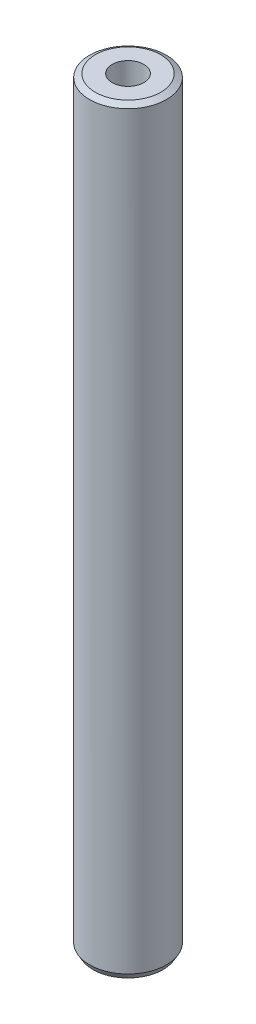
ISO-10303-21;
HEADER;
FILE_DESCRIPTION(('STEP AP214'),'2;1');
FILE_NAME('part.step','',(''),(''),'','','');
FILE_SCHEMA(('AUTOMOTIVE_DESIGN { 1 0 10303 214 1 1 1 1 }'));
ENDSEC;
DATA;
#1=APPLICATION_CONTEXT('core data for automotive mechanical design processes');
#2=APPLICATION_PROTOCOL_DEFINITION('international standard','automotive_design',2000,#1);
#3=PRODUCT_CONTEXT('',#1,'mechanical');
#4=PRODUCT('Part','Part','',(#3));
#5=PRODUCT_RELATED_PRODUCT_CATEGORY('part','',(#4));
#6=PRODUCT_DEFINITION_FORMATION('','',#4);
#7=PRODUCT_DEFINITION_CONTEXT('part definition',#1,'design');
#8=PRODUCT_DEFINITION('design','',#6,#7);
#9=PRODUCT_DEFINITION_SHAPE('','',#8);
#10=(LENGTH_UNIT() NAMED_UNIT(*) SI_UNIT(.MILLI.,.METRE.));
#11=(NAMED_UNIT(*) PLANE_ANGLE_UNIT() SI_UNIT($,.RADIAN.));
#12=(NAMED_UNIT(*) SI_UNIT($,.STERADIAN.) SOLID_ANGLE_UNIT());
#13=UNCERTAINTY_MEASURE_WITH_UNIT(LENGTH_MEASURE(1.E-05),#10,'distance_accuracy_value','');
#14=(GEOMETRIC_REPRESENTATION_CONTEXT(3) GLOBAL_UNCERTAINTY_ASSIGNED_CONTEXT((#13)) GLOBAL_UNIT_ASSIGNED_CONTEXT((#10,
#11,#12)) REPRESENTATION_CONTEXT('',''));
#15=CARTESIAN_POINT('',(0.,0.,0.));
#16=DIRECTION('',(0.,0.,1.));
#17=DIRECTION('',(1.,0.,0.));
#18=AXIS2_PLACEMENT_3D('',#15,#16,#17);
#19=CARTESIAN_POINT('',(0.,493.208778863067,0.));
#20=DIRECTION('',(0.,-1.,0.));
#21=DIRECTION('',(0.,0.,-1.));
#22=AXIS2_PLACEMENT_3D('',#19,#20,#21);
#23=CYLINDRICAL_SURFACE('',#22,25.);
#24=CARTESIAN_POINT('',(0.,491.027325995517,0.));
#25=DIRECTION('',(0.,1.,0.));
#26=DIRECTION('',(0.,0.,1.));
#27=AXIS2_PLACEMENT_3D('',#24,#25,#26);
#28=CIRCLE('',#27,25.);
#29=CARTESIAN_POINT('',(0.,491.027325995517,-25.));
#30=VERTEX_POINT('',#29);
#31=EDGE_CURVE('E50',#30,#30,#28,.F.);
#32=CARTESIAN_POINT('',(0.,3.77838720091417,0.));
#33=DIRECTION('',(0.,1.,0.));
#34=DIRECTION('',(0.,0.,1.));
#35=AXIS2_PLACEMENT_3D('',#32,#33,#34);
#36=CIRCLE('',#35,25.);
#37=CARTESIAN_POINT('',(0.,3.77838720091411,-25.));
#38=VERTEX_POINT('',#37);
#39=EDGE_CURVE('E51',#38,#38,#36,.T.);
#40=CARTESIAN_POINT('',(0.,491.027325995517,-25.));
#41=CARTESIAN_POINT('',(0.,485.951816216407,-25.));
#42=CARTESIAN_POINT('',(0.,480.876306437297,-25.));
#43=CARTESIAN_POINT('',(0.,470.725286879076,-25.));
#44=CARTESIAN_POINT('',(0.,465.649777099965,-25.));
#45=CARTESIAN_POINT('',(0.,455.498757541744,-25.));
#46=CARTESIAN_POINT('',(0.,450.423247762634,-25.));
#47=CARTESIAN_POINT('',(0.,440.272228204413,-25.));
#48=CARTESIAN_POINT('',(0.,435.196718425302,-25.));
#49=CARTESIAN_POINT('',(0.,425.045698867082,-25.));
#50=CARTESIAN_POINT('',(0.,419.970189087971,-25.));
#51=CARTESIAN_POINT('',(0.,409.81916952975,-25.));
#52=CARTESIAN_POINT('',(0.,404.74365975064,-25.));
#53=CARTESIAN_POINT('',(0.,394.592640192419,-25.));
#54=CARTESIAN_POINT('',(0.,389.517130413308,-25.));
#55=CARTESIAN_POINT('',(0.,379.366110855087,-25.));
#56=CARTESIAN_POINT('',(0.,374.290601075977,-25.));
#57=CARTESIAN_POINT('',(0.,364.139581517756,-25.));
#58=CARTESIAN_POINT('',(0.,359.064071738646,-25.));
#59=CARTESIAN_POINT('',(0.,348.913052180425,-25.));
#60=CARTESIAN_POINT('',(0.,343.837542401314,-25.));
#61=CARTESIAN_POINT('',(0.,333.686522843093,-25.));
#62=CARTESIAN_POINT('',(0.,328.611013063983,-25.));
#63=CARTESIAN_POINT('',(0.,318.459993505762,-25.));
#64=CARTESIAN_POINT('',(0.,313.384483726652,-25.));
#65=CARTESIAN_POINT('',(0.,303.233464168431,-25.));
#66=CARTESIAN_POINT('',(0.,298.15795438932,-25.));
#67=CARTESIAN_POINT('',(0.,288.006934831099,-25.));
#68=CARTESIAN_POINT('',(0.,282.931425051989,-25.));
#69=CARTESIAN_POINT('',(0.,272.780405493768,-25.));
#70=CARTESIAN_POINT('',(0.,267.704895714658,-25.));
#71=CARTESIAN_POINT('',(0.,257.553876156437,-25.));
#72=CARTESIAN_POINT('',(0.,252.478366377326,-25.));
#73=CARTESIAN_POINT('',(0.,242.327346819105,-25.));
#74=CARTESIAN_POINT('',(0.,237.251837039995,-25.));
#75=CARTESIAN_POINT('',(0.,227.100817481774,-25.));
#76=CARTESIAN_POINT('',(0.,222.025307702664,-25.));
#77=CARTESIAN_POINT('',(0.,211.874288144443,-25.));
#78=CARTESIAN_POINT('',(0.,206.798778365332,-25.));
#79=CARTESIAN_POINT('',(0.,196.647758807111,-25.));
#80=CARTESIAN_POINT('',(0.,191.572249028001,-25.));
#81=CARTESIAN_POINT('',(0.,181.42122946978,-25.));
#82=CARTESIAN_POINT('',(0.,176.345719690669,-25.));
#83=CARTESIAN_POINT('',(0.,166.194700132449,-25.));
#84=CARTESIAN_POINT('',(0.,161.119190353338,-25.));
#85=CARTESIAN_POINT('',(0.,150.968170795117,-25.));
#86=CARTESIAN_POINT('',(0.,145.892661016007,-25.));
#87=CARTESIAN_POINT('',(0.,135.741641457786,-25.));
#88=CARTESIAN_POINT('',(0.,130.666131678675,-25.));
#89=CARTESIAN_POINT('',(0.,120.515112120455,-25.));
#90=CARTESIAN_POINT('',(0.,115.439602341344,-25.));
#91=CARTESIAN_POINT('',(0.,105.288582783123,-25.));
#92=CARTESIAN_POINT('',(0.,100.213073004013,-25.));
#93=CARTESIAN_POINT('',(0.,90.0620534457918,-25.));
#94=CARTESIAN_POINT('',(0.,84.9865436666813,-25.));
#95=CARTESIAN_POINT('',(0.,74.8355241084604,-25.));
#96=CARTESIAN_POINT('',(0.,69.76001432935,-25.));
#97=CARTESIAN_POINT('',(0.,59.6089947711291,-25.));
#98=CARTESIAN_POINT('',(0.,54.5334849920187,-25.));
#99=CARTESIAN_POINT('',(0.,44.3824654337978,-25.));
#100=CARTESIAN_POINT('',(0.,39.3069556546873,-25.));
#101=CARTESIAN_POINT('',(0.,29.1559360964664,-25.));
#102=CARTESIAN_POINT('',(0.,24.0804263173559,-25.));
#103=CARTESIAN_POINT('',(0.,13.929406759135,-25.));
#104=CARTESIAN_POINT('',(0.,8.85389698002458,-25.));
#105=CARTESIAN_POINT('',(0.,3.77838720091411,-25.));
#106=B_SPLINE_CURVE_WITH_KNOTS('',3,(#40,#41,#42,#43,#44,#45,#46,#47,#48,#49,#50,#51,#52,#53,
#54,#55,#56,#57,#58,#59,#60,#61,#62,#63,#64,#65,#66,#67,#68,#69,#70,#71,#72,#73,#74,#75,#76,#77,
#78,#79,#80,#81,#82,#83,#84,#85,#86,#87,#88,#89,#90,#91,#92,#93,#94,#95,#96,#97,#98,#99,#100,
#101,#102,#103,#104,#105),.UNSPECIFIED.,.F.,.F.,(4,2,2,2,2,2,2,2,2,2,2,2,2,2,2,2,2,2,2,2,2,2,2,
2,2,2,2,2,2,2,2,2,4),(0.,15.2265293373314,30.4530586746627,45.6795880119941,60.9061173493254,
76.1326466866568,91.3591760239881,106.585705361319,121.812234698651,137.038764035982,
152.265293373314,167.491822710645,182.718352047976,197.944881385308,213.171410722639,
228.39794005997,243.624469397302,258.850998734633,274.077528071964,289.304057409296,
304.530586746627,319.757116083958,334.98364542129,350.210174758621,365.436704095952,
380.663233433284,395.889762770615,411.116292107947,426.342821445278,441.569350782609,
456.795880119941,472.022409457272,487.248938794603),.UNSPECIFIED.);
#107=EDGE_CURVE('BSEAM39',#30,#38,#106,.T.);
#108=ORIENTED_EDGE('',*,*,#31,.T.);
#109=ORIENTED_EDGE('',*,*,#39,.T.);
#110=ORIENTED_EDGE('',*,*,#107,.T.);
#111=ORIENTED_EDGE('',*,*,#107,.F.);
#112=EDGE_LOOP('',(#108,#110,#109,#111));
#113=FACE_BOUND('',#112,.T.);
#114=ADVANCED_FACE('F39',(#113),#23,.T.);
#115=CARTESIAN_POINT('',(0.,493.208778863067,0.));
#116=DIRECTION('',(0.,1.,0.));
#117=DIRECTION('',(0.,0.,1.));
#118=AXIS2_PLACEMENT_3D('',#115,#116,#117);
#119=PLANE('',#118);
#120=CARTESIAN_POINT('',(0.,493.208778863067,0.));
#121=DIRECTION('',(0.,1.,0.));
#122=DIRECTION('',(0.,0.,1.));
#123=AXIS2_PLACEMENT_3D('',#120,#121,#122);
#124=CIRCLE('',#123,21.2216127990871);
#125=CARTESIAN_POINT('',(0.,493.208778863067,21.2216127990871));
#126=VERTEX_POINT('',#125);
#127=EDGE_CURVE('E54',#126,#126,#124,.T.);
#128=ORIENTED_EDGE('',*,*,#127,.T.);
#129=EDGE_LOOP('',(#128));
#130=FACE_BOUND('',#129,.T.);
#131=CARTESIAN_POINT('',(0.,493.208778863067,0.));
#132=DIRECTION('',(0.,1.,0.));
#133=DIRECTION('',(0.,0.,1.));
#134=AXIS2_PLACEMENT_3D('',#131,#132,#133);
#135=CIRCLE('',#134,10.2938103328602);
#136=CARTESIAN_POINT('',(0.,493.208778863067,-10.2938103328602));
#137=VERTEX_POINT('',#136);
#138=EDGE_CURVE('E58',#137,#137,#135,.T.);
#139=ORIENTED_EDGE('',*,*,#138,.F.);
#140=EDGE_LOOP('',(#139));
#141=FACE_BOUND('',#140,.T.);
#142=ADVANCED_FACE('F69',(#130,#141),#119,.T.);
#143=CARTESIAN_POINT('',(0.,0.,0.));
#144=DIRECTION('',(0.,1.,0.));
#145=DIRECTION('',(0.,0.,1.));
#146=AXIS2_PLACEMENT_3D('',#143,#144,#145);
#147=PLANE('',#146);
#148=CARTESIAN_POINT('',(0.,0.,0.));
#149=DIRECTION('',(0.,1.,0.));
#150=DIRECTION('',(0.,0.,1.));
#151=AXIS2_PLACEMENT_3D('',#148,#149,#150);
#152=CIRCLE('',#151,22.8185471324495);
#153=CARTESIAN_POINT('',(0.,0.,22.8185471324495));
#154=VERTEX_POINT('',#153);
#155=EDGE_CURVE('E10',#154,#154,#152,.F.);
#156=ORIENTED_EDGE('',*,*,#155,.T.);
#157=EDGE_LOOP('',(#156));
#158=FACE_BOUND('',#157,.T.);
#159=CARTESIAN_POINT('',(0.,0.,0.));
#160=DIRECTION('',(0.,1.,0.));
#161=DIRECTION('',(0.,0.,1.));
#162=AXIS2_PLACEMENT_3D('',#159,#160,#161);
#163=CIRCLE('',#162,10.2938103328602);
#164=CARTESIAN_POINT('',(0.,0.,-10.2938103328602));
#165=VERTEX_POINT('',#164);
#166=EDGE_CURVE('E63',#165,#165,#163,.T.);
#167=ORIENTED_EDGE('',*,*,#166,.T.);
#168=EDGE_LOOP('',(#167));
#169=FACE_BOUND('',#168,.T.);
#170=ADVANCED_FACE('F75',(#158,#169),#147,.F.);
#171=CARTESIAN_POINT('',(0.,493.208778863067,0.));
#172=DIRECTION('',(0.,-1.,0.));
#173=DIRECTION('',(0.,0.,-1.));
#174=AXIS2_PLACEMENT_3D('',#171,#172,#173);
#175=CYLINDRICAL_SURFACE('',#174,10.2938103328602);
#176=CARTESIAN_POINT('',(0.,493.208778863067,-10.2938103328602));
#177=CARTESIAN_POINT('',(0.,488.071187416577,-10.2938103328602));
#178=CARTESIAN_POINT('',(0.,482.933595970087,-10.2938103328602));
#179=CARTESIAN_POINT('',(0.,472.658413077106,-10.2938103328602));
#180=CARTESIAN_POINT('',(0.,467.520821630616,-10.2938103328602));
#181=CARTESIAN_POINT('',(0.,457.245638737635,-10.2938103328602));
#182=CARTESIAN_POINT('',(0.,452.108047291145,-10.2938103328602));
#183=CARTESIAN_POINT('',(0.,441.832864398164,-10.2938103328602));
#184=CARTESIAN_POINT('',(0.,436.695272951674,-10.2938103328602));
#185=CARTESIAN_POINT('',(0.,426.420090058693,-10.2938103328602));
#186=CARTESIAN_POINT('',(0.,421.282498612203,-10.2938103328602));
#187=CARTESIAN_POINT('',(0.,411.007315719223,-10.2938103328602));
#188=CARTESIAN_POINT('',(0.,405.869724272732,-10.2938103328602));
#189=CARTESIAN_POINT('',(0.,395.594541379752,-10.2938103328602));
#190=CARTESIAN_POINT('',(0.,390.456949933261,-10.2938103328602));
#191=CARTESIAN_POINT('',(0.,380.181767040281,-10.2938103328602));
#192=CARTESIAN_POINT('',(0.,375.044175593791,-10.2938103328602));
#193=CARTESIAN_POINT('',(0.,364.76899270081,-10.2938103328602));
#194=CARTESIAN_POINT('',(0.,359.63140125432,-10.2938103328602));
#195=CARTESIAN_POINT('',(0.,349.356218361339,-10.2938103328602));
#196=CARTESIAN_POINT('',(0.,344.218626914849,-10.2938103328602));
#197=CARTESIAN_POINT('',(0.,333.943444021868,-10.2938103328602));
#198=CARTESIAN_POINT('',(0.,328.805852575378,-10.2938103328602));
#199=CARTESIAN_POINT('',(0.,318.530669682398,-10.2938103328602));
#200=CARTESIAN_POINT('',(0.,313.393078235907,-10.2938103328602));
#201=CARTESIAN_POINT('',(0.,303.117895342927,-10.2938103328602));
#202=CARTESIAN_POINT('',(0.,297.980303896436,-10.2938103328602));
#203=CARTESIAN_POINT('',(0.,287.705121003456,-10.2938103328602));
#204=CARTESIAN_POINT('',(0.,282.567529556965,-10.2938103328602));
#205=CARTESIAN_POINT('',(0.,272.292346663985,-10.2938103328602));
#206=CARTESIAN_POINT('',(0.,267.154755217495,-10.2938103328602));
#207=CARTESIAN_POINT('',(0.,256.879572324514,-10.2938103328602));
#208=CARTESIAN_POINT('',(0.,251.741980878024,-10.2938103328602));
#209=CARTESIAN_POINT('',(0.,241.466797985043,-10.2938103328602));
#210=CARTESIAN_POINT('',(0.,236.329206538553,-10.2938103328602));
#211=CARTESIAN_POINT('',(0.,226.054023645572,-10.2938103328602));
#212=CARTESIAN_POINT('',(0.,220.916432199082,-10.2938103328602));
#213=CARTESIAN_POINT('',(0.,210.641249306102,-10.2938103328602));
#214=CARTESIAN_POINT('',(0.,205.503657859611,-10.2938103328602));
#215=CARTESIAN_POINT('',(0.,195.228474966631,-10.2938103328602));
#216=CARTESIAN_POINT('',(0.,190.09088352014,-10.2938103328602));
#217=CARTESIAN_POINT('',(0.,179.81570062716,-10.2938103328602));
#218=CARTESIAN_POINT('',(0.,174.67810918067,-10.2938103328602));
#219=CARTESIAN_POINT('',(0.,164.402926287689,-10.2938103328602));
#220=CARTESIAN_POINT('',(0.,159.265334841199,-10.2938103328602));
#221=CARTESIAN_POINT('',(0.,148.990151948218,-10.2938103328602));
#222=CARTESIAN_POINT('',(0.,143.852560501728,-10.2938103328602));
#223=CARTESIAN_POINT('',(0.,133.577377608747,-10.2938103328602));
#224=CARTESIAN_POINT('',(0.,128.439786162257,-10.2938103328602));
#225=CARTESIAN_POINT('',(0.,118.164603269276,-10.2938103328602));
#226=CARTESIAN_POINT('',(0.,113.027011822786,-10.2938103328602));
#227=CARTESIAN_POINT('',(0.,102.751828929806,-10.2938103328602));
#228=CARTESIAN_POINT('',(0.,97.6142374833153,-10.2938103328602));
#229=CARTESIAN_POINT('',(0.,87.3390545903348,-10.2938103328602));
#230=CARTESIAN_POINT('',(0.,82.2014631438445,-10.2938103328602));
#231=CARTESIAN_POINT('',(0.,71.9262802508639,-10.2938103328602));
#232=CARTESIAN_POINT('',(0.,66.7886888043736,-10.2938103328602));
#233=CARTESIAN_POINT('',(0.,56.5135059113931,-10.2938103328602));
#234=CARTESIAN_POINT('',(0.,51.3759144649028,-10.2938103328602));
#235=CARTESIAN_POINT('',(0.,41.1007315719222,-10.2938103328602));
#236=CARTESIAN_POINT('',(0.,35.9631401254319,-10.2938103328602));
#237=CARTESIAN_POINT('',(0.,25.6879572324514,-10.2938103328602));
#238=CARTESIAN_POINT('',(0.,20.5503657859611,-10.2938103328602));
#239=CARTESIAN_POINT('',(0.,10.2751828929805,-10.2938103328602));
#240=CARTESIAN_POINT('',(0.,5.13759144649022,-10.2938103328602));
#241=CARTESIAN_POINT('',(0.,0.,-10.2938103328602));
#242=B_SPLINE_CURVE_WITH_KNOTS('',3,(#176,#177,#178,#179,#180,#181,#182,#183,#184,#185,#186,
#187,#188,#189,#190,#191,#192,#193,#194,#195,#196,#197,#198,#199,#200,#201,#202,#203,#204,#205,
#206,#207,#208,#209,#210,#211,#212,#213,#214,#215,#216,#217,#218,#219,#220,#221,#222,#223,#224,
#225,#226,#227,#228,#229,#230,#231,#232,#233,#234,#235,#236,#237,#238,#239,#240,#241),
.UNSPECIFIED.,.F.,.F.,(4,2,2,2,2,2,2,2,2,2,2,2,2,2,2,2,2,2,2,2,2,2,2,2,2,2,2,2,2,2,2,2,4),(0.,
15.4127743394708,30.8255486789417,46.2383230184125,61.6510973578834,77.0638716973542,
92.476646036825,107.889420376296,123.302194715767,138.714969055238,154.127743394708,
169.540517734179,184.95329207365,200.366066413121,215.778840752592,231.191615092063,
246.604389431534,262.017163771004,277.429938110475,292.842712449946,308.255486789417,
323.668261128888,339.081035468359,354.493809807829,369.9065841473,385.319358486771,
400.732132826242,416.144907165713,431.557681505184,446.970455844655,462.383230184125,
477.796004523596,493.208778863067),.UNSPECIFIED.);
#243=EDGE_CURVE('BSEAM70',#137,#165,#242,.T.);
#244=ORIENTED_EDGE('',*,*,#138,.T.);
#245=ORIENTED_EDGE('',*,*,#166,.F.);
#246=ORIENTED_EDGE('',*,*,#243,.T.);
#247=ORIENTED_EDGE('',*,*,#243,.F.);
#248=EDGE_LOOP('',(#244,#246,#245,#247));
#249=FACE_BOUND('',#248,.T.);
#250=ADVANCED_FACE('F70',(#249),#175,.F.);
#251=CARTESIAN_POINT('',(0.,493.208778863067,0.));
#252=DIRECTION('',(0.,-1.,0.));
#253=DIRECTION('',(0.,0.,-1.));
#254=AXIS2_PLACEMENT_3D('',#251,#252,#253);
#255=CONICAL_SURFACE('',#254,21.2216127990871,1.0471975511966);
#256=ORIENTED_EDGE('',*,*,#31,.F.);
#257=EDGE_LOOP('',(#256));
#258=FACE_BOUND('',#257,.T.);
#259=ORIENTED_EDGE('',*,*,#127,.F.);
#260=EDGE_LOOP('',(#259));
#261=FACE_BOUND('',#260,.T.);
#262=ADVANCED_FACE('F81',(#258,#261),#255,.T.);
#263=CARTESIAN_POINT('',(0.,3.77838720091417,0.));
#264=DIRECTION('',(0.,1.,0.));
#265=DIRECTION('',(0.,0.,1.));
#266=AXIS2_PLACEMENT_3D('',#263,#264,#265);
#267=CONICAL_SURFACE('',#266,25.,0.523598775598305);
#268=ORIENTED_EDGE('',*,*,#155,.F.);
#269=EDGE_LOOP('',(#268));
#270=FACE_BOUND('',#269,.T.);
#271=ORIENTED_EDGE('',*,*,#39,.F.);
#272=EDGE_LOOP('',(#271));
#273=FACE_BOUND('',#272,.T.);
#274=ADVANCED_FACE('F45',(#270,#273),#267,.T.);
#275=CLOSED_SHELL('',(#114,#142,#170,#250,#262,#274));
#276=MANIFOLD_SOLID_BREP('B2',#275);
#277=ADVANCED_BREP_SHAPE_REPRESENTATION('',(#18,#276),#14);
#278=SHAPE_DEFINITION_REPRESENTATION(#9,#277);
ENDSEC;
END-ISO-10303-21;
